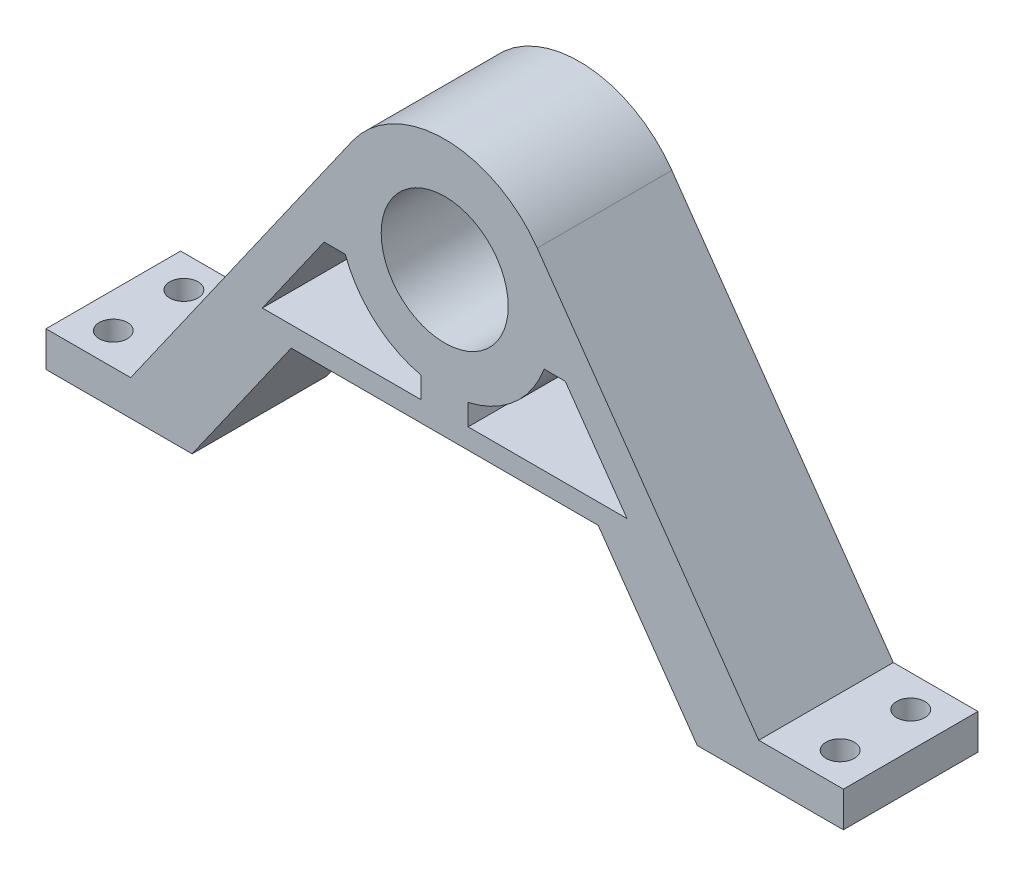
ISO-10303-21;
HEADER;
FILE_DESCRIPTION(('STEP AP214'),'2;1');
FILE_NAME('part.step','',(''),(''),'','','');
FILE_SCHEMA(('AUTOMOTIVE_DESIGN { 1 0 10303 214 1 1 1 1 }'));
ENDSEC;
DATA;
#1=APPLICATION_CONTEXT('core data for automotive mechanical design processes');
#2=APPLICATION_PROTOCOL_DEFINITION('international standard','automotive_design',2000,#1);
#3=PRODUCT_CONTEXT('',#1,'mechanical');
#4=PRODUCT('Part','Part','',(#3));
#5=PRODUCT_RELATED_PRODUCT_CATEGORY('part','',(#4));
#6=PRODUCT_DEFINITION_FORMATION('','',#4);
#7=PRODUCT_DEFINITION_CONTEXT('part definition',#1,'design');
#8=PRODUCT_DEFINITION('design','',#6,#7);
#9=PRODUCT_DEFINITION_SHAPE('','',#8);
#10=(LENGTH_UNIT() NAMED_UNIT(*) SI_UNIT(.MILLI.,.METRE.));
#11=(NAMED_UNIT(*) PLANE_ANGLE_UNIT() SI_UNIT($,.RADIAN.));
#12=(NAMED_UNIT(*) SI_UNIT($,.STERADIAN.) SOLID_ANGLE_UNIT());
#13=UNCERTAINTY_MEASURE_WITH_UNIT(LENGTH_MEASURE(1.E-05),#10,'distance_accuracy_value','');
#14=(GEOMETRIC_REPRESENTATION_CONTEXT(3) GLOBAL_UNCERTAINTY_ASSIGNED_CONTEXT((#13)) GLOBAL_UNIT_ASSIGNED_CONTEXT((#10,
#11,#12)) REPRESENTATION_CONTEXT('',''));
#15=CARTESIAN_POINT('',(0.,0.,0.));
#16=DIRECTION('',(0.,0.,1.));
#17=DIRECTION('',(1.,0.,0.));
#18=AXIS2_PLACEMENT_3D('',#15,#16,#17);
#19=CARTESIAN_POINT('',(0.,40.5,19.075));
#20=DIRECTION('',(0.,0.,-1.));
#21=DIRECTION('',(-1.,0.,0.));
#22=AXIS2_PLACEMENT_3D('',#19,#20,#21);
#23=CYLINDRICAL_SURFACE('',#22,9.);
#24=CARTESIAN_POINT('',(0.,40.5,19.075));
#25=DIRECTION('',(0.,0.,1.));
#26=DIRECTION('',(1.,0.,0.));
#27=AXIS2_PLACEMENT_3D('',#24,#25,#26);
#28=CIRCLE('',#27,9.);
#29=CARTESIAN_POINT('',(9.,40.5,19.075));
#30=VERTEX_POINT('',#29);
#31=EDGE_CURVE('E268',#30,#30,#28,.T.);
#32=ORIENTED_EDGE('',*,*,#31,.T.);
#33=EDGE_LOOP('',(#32));
#34=FACE_BOUND('',#33,.T.);
#35=CARTESIAN_POINT('',(0.,40.5,5.5));
#36=DIRECTION('',(0.,0.,-1.));
#37=DIRECTION('',(-1.,0.,0.));
#38=AXIS2_PLACEMENT_3D('',#35,#36,#37);
#39=CIRCLE('',#38,9.);
#40=CARTESIAN_POINT('',(-9.,40.5,5.5));
#41=VERTEX_POINT('',#40);
#42=EDGE_CURVE('E39',#41,#41,#39,.T.);
#43=ORIENTED_EDGE('',*,*,#42,.T.);
#44=EDGE_LOOP('',(#43));
#45=FACE_BOUND('',#44,.T.);
#46=ADVANCED_FACE('F35',(#34,#45),#23,.F.);
#47=CARTESIAN_POINT('',(0.,40.5,19.075));
#48=DIRECTION('',(0.,0.,1.));
#49=DIRECTION('',(1.,0.,0.));
#50=AXIS2_PLACEMENT_3D('',#47,#48,#49);
#51=PLANE('',#50);
#52=DIRECTION('',(1.,0.,0.));
#53=VECTOR('',#52,1.);
#54=CARTESIAN_POINT('',(56.5,0.,19.075));
#55=LINE('',#54,#53);
#56=CARTESIAN_POINT('',(35.791970862888,0.,19.075));
#57=VERTEX_POINT('',#56);
#58=CARTESIAN_POINT('',(56.5,0.,19.075));
#59=VERTEX_POINT('',#58);
#60=EDGE_CURVE('E272',#57,#59,#55,.T.);
#61=ORIENTED_EDGE('',*,*,#60,.T.);
#62=DIRECTION('',(0.,1.,0.));
#63=VECTOR('',#62,1.);
#64=CARTESIAN_POINT('',(56.5,0.,19.075));
#65=LINE('',#64,#63);
#66=CARTESIAN_POINT('',(56.5,5.,19.075));
#67=VERTEX_POINT('',#66);
#68=EDGE_CURVE('E275',#59,#67,#65,.T.);
#69=ORIENTED_EDGE('',*,*,#68,.T.);
#70=DIRECTION('',(-1.,0.,0.));
#71=VECTOR('',#70,1.);
#72=CARTESIAN_POINT('',(56.5,5.,19.075));
#73=LINE('',#72,#71);
#74=CARTESIAN_POINT('',(44.5,5.,19.075));
#75=VERTEX_POINT('',#74);
#76=EDGE_CURVE('E278',#67,#75,#73,.T.);
#77=ORIENTED_EDGE('',*,*,#76,.T.);
#78=DIRECTION('',(-0.574555500167892,0.818465623729442,0.));
#79=VECTOR('',#78,1.);
#80=CARTESIAN_POINT('',(13.1159116202643,49.7072518901905,19.075));
#81=LINE('',#80,#79);
#82=CARTESIAN_POINT('',(13.1159116202643,49.7072518901905,19.075));
#83=VERTEX_POINT('',#82);
#84=EDGE_CURVE('E280',#75,#83,#81,.T.);
#85=ORIENTED_EDGE('',*,*,#84,.T.);
#86=CARTESIAN_POINT('',(0.,40.5,19.075));
#87=DIRECTION('',(0.,0.,1.));
#88=DIRECTION('',(1.,0.,0.));
#89=AXIS2_PLACEMENT_3D('',#86,#87,#88);
#90=CIRCLE('',#89,16.025);
#91=CARTESIAN_POINT('',(-13.1159116202643,49.7072518901905,19.075));
#92=VERTEX_POINT('',#91);
#93=EDGE_CURVE('E282',#83,#92,#90,.T.);
#94=ORIENTED_EDGE('',*,*,#93,.T.);
#95=DIRECTION('',(-0.574555500167892,-0.818465623729442,0.));
#96=VECTOR('',#95,1.);
#97=CARTESIAN_POINT('',(-13.1159116202643,49.7072518901905,19.075));
#98=LINE('',#97,#96);
#99=CARTESIAN_POINT('',(-44.5,5.,19.075));
#100=VERTEX_POINT('',#99);
#101=EDGE_CURVE('E284',#92,#100,#98,.T.);
#102=ORIENTED_EDGE('',*,*,#101,.T.);
#103=DIRECTION('',(-1.,0.,0.));
#104=VECTOR('',#103,1.);
#105=CARTESIAN_POINT('',(-56.5,5.,19.075));
#106=LINE('',#105,#104);
#107=CARTESIAN_POINT('',(-56.5,5.,19.075));
#108=VERTEX_POINT('',#107);
#109=EDGE_CURVE('E286',#100,#108,#106,.T.);
#110=ORIENTED_EDGE('',*,*,#109,.T.);
#111=DIRECTION('',(0.,-1.,0.));
#112=VECTOR('',#111,1.);
#113=CARTESIAN_POINT('',(-56.5,0.,19.075));
#114=LINE('',#113,#112);
#115=CARTESIAN_POINT('',(-56.5,0.,19.075));
#116=VERTEX_POINT('',#115);
#117=EDGE_CURVE('E288',#108,#116,#114,.T.);
#118=ORIENTED_EDGE('',*,*,#117,.T.);
#119=DIRECTION('',(1.,0.,0.));
#120=VECTOR('',#119,1.);
#121=CARTESIAN_POINT('',(-56.5,0.,19.075));
#122=LINE('',#121,#120);
#123=CARTESIAN_POINT('',(-35.791970862888,0.,19.075));
#124=VERTEX_POINT('',#123);
#125=EDGE_CURVE('E290',#116,#124,#122,.T.);
#126=ORIENTED_EDGE('',*,*,#125,.T.);
#127=DIRECTION('',(0.574555500167892,0.818465623729441,0.));
#128=VECTOR('',#127,1.);
#129=CARTESIAN_POINT('',(-35.791970862888,0.,19.075));
#130=LINE('',#129,#128);
#131=CARTESIAN_POINT('',(-21.7521508995312,20.,19.075));
#132=VERTEX_POINT('',#131);
#133=EDGE_CURVE('E292',#124,#132,#130,.T.);
#134=ORIENTED_EDGE('',*,*,#133,.T.);
#135=DIRECTION('',(1.,0.,0.));
#136=VECTOR('',#135,1.);
#137=CARTESIAN_POINT('',(-21.7521508995312,20.,19.075));
#138=LINE('',#137,#136);
#139=CARTESIAN_POINT('',(21.7521508995312,20.,19.075));
#140=VERTEX_POINT('',#139);
#141=EDGE_CURVE('E294',#132,#140,#138,.T.);
#142=ORIENTED_EDGE('',*,*,#141,.T.);
#143=DIRECTION('',(0.574555500167891,-0.818465623729442,0.));
#144=VECTOR('',#143,1.);
#145=CARTESIAN_POINT('',(35.791970862888,0.,19.075));
#146=LINE('',#145,#144);
#147=EDGE_CURVE('E296',#140,#57,#146,.T.);
#148=ORIENTED_EDGE('',*,*,#147,.T.);
#149=EDGE_LOOP('',(#61,#69,#77,#85,#94,#102,#110,#118,#126,#134,#142,#148));
#150=FACE_BOUND('',#149,.T.);
#151=ORIENTED_EDGE('',*,*,#31,.F.);
#152=EDGE_LOOP('',(#151));
#153=FACE_BOUND('',#152,.T.);
#154=DIRECTION('',(-1.,0.,0.));
#155=VECTOR('',#154,1.);
#156=CARTESIAN_POINT('',(-17.0873058961482,35.347543053227,19.075));
#157=LINE('',#156,#155);
#158=CARTESIAN_POINT('',(-14.0873058961482,35.347543053227,19.075));
#159=VERTEX_POINT('',#158);
#160=CARTESIAN_POINT('',(-17.0873058961482,35.347543053227,19.075));
#161=VERTEX_POINT('',#160);
#162=EDGE_CURVE('E233',#159,#161,#157,.T.);
#163=ORIENTED_EDGE('',*,*,#162,.F.);
#164=CARTESIAN_POINT('',(0.,40.5,19.075));
#165=DIRECTION('',(0.,0.,-1.));
#166=DIRECTION('',(-1.,0.,0.));
#167=AXIS2_PLACEMENT_3D('',#164,#165,#166);
#168=CIRCLE('',#167,15.);
#169=CARTESIAN_POINT('',(-3.3233058781959,25.8727775008395,19.075));
#170=VERTEX_POINT('',#169);
#171=EDGE_CURVE('E231',#170,#159,#168,.T.);
#172=ORIENTED_EDGE('',*,*,#171,.F.);
#173=DIRECTION('',(0.,1.,0.));
#174=VECTOR('',#173,1.);
#175=CARTESIAN_POINT('',(-3.3233058781959,22.8727775008395,19.075));
#176=LINE('',#175,#174);
#177=CARTESIAN_POINT('',(-3.3233058781959,22.8727775008395,19.075));
#178=VERTEX_POINT('',#177);
#179=EDGE_CURVE('E241',#178,#170,#176,.T.);
#180=ORIENTED_EDGE('',*,*,#179,.F.);
#181=DIRECTION('',(1.,0.,0.));
#182=VECTOR('',#181,1.);
#183=CARTESIAN_POINT('',(-25.8444790181785,22.8727775008395,19.075));
#184=LINE('',#183,#182);
#185=CARTESIAN_POINT('',(-25.8444790181785,22.8727775008395,19.075));
#186=VERTEX_POINT('',#185);
#187=EDGE_CURVE('E238',#186,#178,#184,.T.);
#188=ORIENTED_EDGE('',*,*,#187,.F.);
#189=DIRECTION('',(-0.574555500167892,-0.818465623729441,0.));
#190=VECTOR('',#189,1.);
#191=CARTESIAN_POINT('',(-17.0873058961482,35.347543053227,19.075));
#192=LINE('',#191,#190);
#193=EDGE_CURVE('E236',#161,#186,#192,.T.);
#194=ORIENTED_EDGE('',*,*,#193,.F.);
#195=EDGE_LOOP('',(#163,#172,#180,#188,#194));
#196=FACE_BOUND('',#195,.T.);
#197=DIRECTION('',(0.,-1.,0.));
#198=VECTOR('',#197,1.);
#199=CARTESIAN_POINT('',(3.3233058781959,22.8727775008394,19.075));
#200=LINE('',#199,#198);
#201=CARTESIAN_POINT('',(3.3233058781959,25.8727775008394,19.075));
#202=VERTEX_POINT('',#201);
#203=CARTESIAN_POINT('',(3.3233058781959,22.8727775008394,19.075));
#204=VERTEX_POINT('',#203);
#205=EDGE_CURVE('E193',#202,#204,#200,.T.);
#206=ORIENTED_EDGE('',*,*,#205,.F.);
#207=CARTESIAN_POINT('',(0.,40.5,19.075));
#208=DIRECTION('',(0.,0.,-1.));
#209=DIRECTION('',(1.,0.,0.));
#210=AXIS2_PLACEMENT_3D('',#207,#208,#209);
#211=CIRCLE('',#210,15.);
#212=CARTESIAN_POINT('',(14.0873058961482,35.347543053227,19.075));
#213=VERTEX_POINT('',#212);
#214=EDGE_CURVE('E185',#213,#202,#211,.T.);
#215=ORIENTED_EDGE('',*,*,#214,.F.);
#216=DIRECTION('',(-1.,0.,0.));
#217=VECTOR('',#216,1.);
#218=CARTESIAN_POINT('',(17.0873058961482,35.347543053227,19.075));
#219=LINE('',#218,#217);
#220=CARTESIAN_POINT('',(17.0873058961482,35.347543053227,19.075));
#221=VERTEX_POINT('',#220);
#222=EDGE_CURVE('E214',#221,#213,#219,.T.);
#223=ORIENTED_EDGE('',*,*,#222,.F.);
#224=DIRECTION('',(-0.574555500167893,0.818465623729441,0.));
#225=VECTOR('',#224,1.);
#226=CARTESIAN_POINT('',(17.0873058961482,35.347543053227,19.075));
#227=LINE('',#226,#225);
#228=CARTESIAN_POINT('',(25.8444790181785,22.8727775008394,19.075));
#229=VERTEX_POINT('',#228);
#230=EDGE_CURVE('E209',#229,#221,#227,.T.);
#231=ORIENTED_EDGE('',*,*,#230,.F.);
#232=DIRECTION('',(1.,0.,0.));
#233=VECTOR('',#232,1.);
#234=CARTESIAN_POINT('',(25.8444790181785,22.8727775008394,19.075));
#235=LINE('',#234,#233);
#236=EDGE_CURVE('E207',#204,#229,#235,.T.);
#237=ORIENTED_EDGE('',*,*,#236,.F.);
#238=EDGE_LOOP('',(#206,#215,#223,#231,#237));
#239=FACE_BOUND('',#238,.T.);
#240=ADVANCED_FACE('F205',(#150,#153,#196,#239),#51,.T.);
#241=CARTESIAN_POINT('',(0.,40.5,0.));
#242=DIRECTION('',(0.,0.,1.));
#243=DIRECTION('',(1.,0.,0.));
#244=AXIS2_PLACEMENT_3D('',#241,#242,#243);
#245=PLANE('',#244);
#246=CARTESIAN_POINT('',(0.,40.5,0.));
#247=DIRECTION('',(0.,0.,-1.));
#248=DIRECTION('',(-1.,0.,0.));
#249=AXIS2_PLACEMENT_3D('',#246,#247,#248);
#250=CIRCLE('',#249,11.025);
#251=CARTESIAN_POINT('',(-11.025,40.5,0.));
#252=VERTEX_POINT('',#251);
#253=EDGE_CURVE('E721',#252,#252,#250,.T.);
#254=ORIENTED_EDGE('',*,*,#253,.F.);
#255=EDGE_LOOP('',(#254));
#256=FACE_BOUND('',#255,.T.);
#257=CARTESIAN_POINT('',(0.,40.5,0.));
#258=DIRECTION('',(0.,0.,-1.));
#259=DIRECTION('',(-1.,0.,0.));
#260=AXIS2_PLACEMENT_3D('',#257,#258,#259);
#261=CIRCLE('',#260,15.);
#262=CARTESIAN_POINT('',(-3.3233058781959,25.8727775008395,0.));
#263=VERTEX_POINT('',#262);
#264=CARTESIAN_POINT('',(-14.0873058961482,35.347543053227,0.));
#265=VERTEX_POINT('',#264);
#266=EDGE_CURVE('E201',#263,#265,#261,.T.);
#267=ORIENTED_EDGE('',*,*,#266,.T.);
#268=DIRECTION('',(-1.,0.,0.));
#269=VECTOR('',#268,1.);
#270=CARTESIAN_POINT('',(-17.0873058961482,35.347543053227,0.));
#271=LINE('',#270,#269);
#272=CARTESIAN_POINT('',(-17.0873058961482,35.347543053227,0.));
#273=VERTEX_POINT('',#272);
#274=EDGE_CURVE('E246',#265,#273,#271,.T.);
#275=ORIENTED_EDGE('',*,*,#274,.T.);
#276=DIRECTION('',(-0.574555500167892,-0.818465623729441,0.));
#277=VECTOR('',#276,1.);
#278=CARTESIAN_POINT('',(-17.0873058961482,35.347543053227,0.));
#279=LINE('',#278,#277);
#280=CARTESIAN_POINT('',(-25.8444790181785,22.8727775008395,0.));
#281=VERTEX_POINT('',#280);
#282=EDGE_CURVE('E249',#273,#281,#279,.T.);
#283=ORIENTED_EDGE('',*,*,#282,.T.);
#284=DIRECTION('',(1.,0.,0.));
#285=VECTOR('',#284,1.);
#286=CARTESIAN_POINT('',(-25.8444790181785,22.8727775008395,0.));
#287=LINE('',#286,#285);
#288=CARTESIAN_POINT('',(-3.3233058781959,22.8727775008395,0.));
#289=VERTEX_POINT('',#288);
#290=EDGE_CURVE('E252',#281,#289,#287,.T.);
#291=ORIENTED_EDGE('',*,*,#290,.T.);
#292=DIRECTION('',(0.,1.,0.));
#293=VECTOR('',#292,1.);
#294=CARTESIAN_POINT('',(-3.3233058781959,22.8727775008395,0.));
#295=LINE('',#294,#293);
#296=EDGE_CURVE('E234',#289,#263,#295,.T.);
#297=ORIENTED_EDGE('',*,*,#296,.T.);
#298=EDGE_LOOP('',(#267,#275,#283,#291,#297));
#299=FACE_BOUND('',#298,.T.);
#300=DIRECTION('',(1.,0.,0.));
#301=VECTOR('',#300,1.);
#302=CARTESIAN_POINT('',(56.5,0.,0.));
#303=LINE('',#302,#301);
#304=CARTESIAN_POINT('',(35.791970862888,0.,0.));
#305=VERTEX_POINT('',#304);
#306=CARTESIAN_POINT('',(56.5,0.,0.));
#307=VERTEX_POINT('',#306);
#308=EDGE_CURVE('E271',#305,#307,#303,.T.);
#309=ORIENTED_EDGE('',*,*,#308,.F.);
#310=DIRECTION('',(0.574555500167891,-0.818465623729442,0.));
#311=VECTOR('',#310,1.);
#312=CARTESIAN_POINT('',(35.791970862888,0.,0.));
#313=LINE('',#312,#311);
#314=CARTESIAN_POINT('',(21.7521508995312,20.,0.));
#315=VERTEX_POINT('',#314);
#316=EDGE_CURVE('E276',#315,#305,#313,.T.);
#317=ORIENTED_EDGE('',*,*,#316,.F.);
#318=DIRECTION('',(1.,0.,0.));
#319=VECTOR('',#318,1.);
#320=CARTESIAN_POINT('',(-21.7521508995312,20.,0.));
#321=LINE('',#320,#319);
#322=CARTESIAN_POINT('',(-21.7521508995312,20.,0.));
#323=VERTEX_POINT('',#322);
#324=EDGE_CURVE('E319',#323,#315,#321,.T.);
#325=ORIENTED_EDGE('',*,*,#324,.F.);
#326=DIRECTION('',(0.574555500167892,0.818465623729441,0.));
#327=VECTOR('',#326,1.);
#328=CARTESIAN_POINT('',(-35.791970862888,0.,0.));
#329=LINE('',#328,#327);
#330=CARTESIAN_POINT('',(-35.791970862888,0.,0.));
#331=VERTEX_POINT('',#330);
#332=EDGE_CURVE('E317',#331,#323,#329,.T.);
#333=ORIENTED_EDGE('',*,*,#332,.F.);
#334=DIRECTION('',(1.,0.,0.));
#335=VECTOR('',#334,1.);
#336=CARTESIAN_POINT('',(-56.5,0.,0.));
#337=LINE('',#336,#335);
#338=CARTESIAN_POINT('',(-56.5,0.,0.));
#339=VERTEX_POINT('',#338);
#340=EDGE_CURVE('E315',#339,#331,#337,.T.);
#341=ORIENTED_EDGE('',*,*,#340,.F.);
#342=DIRECTION('',(0.,-1.,0.));
#343=VECTOR('',#342,1.);
#344=CARTESIAN_POINT('',(-56.5,0.,0.));
#345=LINE('',#344,#343);
#346=CARTESIAN_POINT('',(-56.5,5.,0.));
#347=VERTEX_POINT('',#346);
#348=EDGE_CURVE('E313',#347,#339,#345,.T.);
#349=ORIENTED_EDGE('',*,*,#348,.F.);
#350=DIRECTION('',(-1.,0.,0.));
#351=VECTOR('',#350,1.);
#352=CARTESIAN_POINT('',(-56.5,5.,0.));
#353=LINE('',#352,#351);
#354=CARTESIAN_POINT('',(-44.5,5.,0.));
#355=VERTEX_POINT('',#354);
#356=EDGE_CURVE('E311',#355,#347,#353,.T.);
#357=ORIENTED_EDGE('',*,*,#356,.F.);
#358=DIRECTION('',(-0.574555500167892,-0.818465623729442,0.));
#359=VECTOR('',#358,1.);
#360=CARTESIAN_POINT('',(-13.1159116202643,49.7072518901905,0.));
#361=LINE('',#360,#359);
#362=CARTESIAN_POINT('',(-13.1159116202643,49.7072518901905,0.));
#363=VERTEX_POINT('',#362);
#364=EDGE_CURVE('E309',#363,#355,#361,.T.);
#365=ORIENTED_EDGE('',*,*,#364,.F.);
#366=CARTESIAN_POINT('',(0.,40.5,0.));
#367=DIRECTION('',(0.,0.,1.));
#368=DIRECTION('',(1.,0.,0.));
#369=AXIS2_PLACEMENT_3D('',#366,#367,#368);
#370=CIRCLE('',#369,16.025);
#371=CARTESIAN_POINT('',(13.1159116202643,49.7072518901905,0.));
#372=VERTEX_POINT('',#371);
#373=EDGE_CURVE('E307',#372,#363,#370,.T.);
#374=ORIENTED_EDGE('',*,*,#373,.F.);
#375=DIRECTION('',(-0.574555500167892,0.818465623729442,0.));
#376=VECTOR('',#375,1.);
#377=CARTESIAN_POINT('',(13.1159116202643,49.7072518901905,0.));
#378=LINE('',#377,#376);
#379=CARTESIAN_POINT('',(44.5,5.,0.));
#380=VERTEX_POINT('',#379);
#381=EDGE_CURVE('E305',#380,#372,#378,.T.);
#382=ORIENTED_EDGE('',*,*,#381,.F.);
#383=DIRECTION('',(-1.,0.,0.));
#384=VECTOR('',#383,1.);
#385=CARTESIAN_POINT('',(56.5,5.,0.));
#386=LINE('',#385,#384);
#387=CARTESIAN_POINT('',(56.5,5.,0.));
#388=VERTEX_POINT('',#387);
#389=EDGE_CURVE('E303',#388,#380,#386,.T.);
#390=ORIENTED_EDGE('',*,*,#389,.F.);
#391=DIRECTION('',(0.,1.,0.));
#392=VECTOR('',#391,1.);
#393=CARTESIAN_POINT('',(56.5,0.,0.));
#394=LINE('',#393,#392);
#395=EDGE_CURVE('E301',#307,#388,#394,.T.);
#396=ORIENTED_EDGE('',*,*,#395,.F.);
#397=EDGE_LOOP('',(#309,#317,#325,#333,#341,#349,#357,#365,#374,#382,#390,#396));
#398=FACE_BOUND('',#397,.T.);
#399=CARTESIAN_POINT('',(0.,40.5,0.));
#400=DIRECTION('',(0.,0.,-1.));
#401=DIRECTION('',(1.,0.,0.));
#402=AXIS2_PLACEMENT_3D('',#399,#400,#401);
#403=CIRCLE('',#402,15.);
#404=CARTESIAN_POINT('',(14.0873058961482,35.347543053227,0.));
#405=VERTEX_POINT('',#404);
#406=CARTESIAN_POINT('',(3.3233058781959,25.8727775008394,0.));
#407=VERTEX_POINT('',#406);
#408=EDGE_CURVE('E59',#405,#407,#403,.T.);
#409=ORIENTED_EDGE('',*,*,#408,.T.);
#410=DIRECTION('',(0.,-1.,0.));
#411=VECTOR('',#410,1.);
#412=CARTESIAN_POINT('',(3.3233058781959,22.8727775008394,0.));
#413=LINE('',#412,#411);
#414=CARTESIAN_POINT('',(3.3233058781959,22.8727775008394,0.));
#415=VERTEX_POINT('',#414);
#416=EDGE_CURVE('E200',#407,#415,#413,.T.);
#417=ORIENTED_EDGE('',*,*,#416,.T.);
#418=DIRECTION('',(1.,0.,0.));
#419=VECTOR('',#418,1.);
#420=CARTESIAN_POINT('',(25.8444790181785,22.8727775008394,0.));
#421=LINE('',#420,#419);
#422=CARTESIAN_POINT('',(25.8444790181785,22.8727775008394,0.));
#423=VERTEX_POINT('',#422);
#424=EDGE_CURVE('E218',#415,#423,#421,.T.);
#425=ORIENTED_EDGE('',*,*,#424,.T.);
#426=DIRECTION('',(-0.574555500167893,0.818465623729441,0.));
#427=VECTOR('',#426,1.);
#428=CARTESIAN_POINT('',(17.0873058961482,35.347543053227,0.));
#429=LINE('',#428,#427);
#430=CARTESIAN_POINT('',(17.0873058961482,35.347543053227,0.));
#431=VERTEX_POINT('',#430);
#432=EDGE_CURVE('E221',#423,#431,#429,.T.);
#433=ORIENTED_EDGE('',*,*,#432,.T.);
#434=DIRECTION('',(-1.,0.,0.));
#435=VECTOR('',#434,1.);
#436=CARTESIAN_POINT('',(17.0873058961482,35.347543053227,0.));
#437=LINE('',#436,#435);
#438=EDGE_CURVE('E194',#431,#405,#437,.T.);
#439=ORIENTED_EDGE('',*,*,#438,.T.);
#440=EDGE_LOOP('',(#409,#417,#425,#433,#439));
#441=FACE_BOUND('',#440,.T.);
#442=ADVANCED_FACE('F362',(#256,#299,#398,#441),#245,.F.);
#443=CARTESIAN_POINT('',(56.5,0.,19.075));
#444=DIRECTION('',(0.,1.,0.));
#445=DIRECTION('',(0.,0.,1.));
#446=AXIS2_PLACEMENT_3D('',#443,#444,#445);
#447=PLANE('',#446);
#448=CARTESIAN_POINT('',(51.5,0.,14.5375));
#449=DIRECTION('',(0.,1.,0.));
#450=DIRECTION('',(-1.,0.,0.));
#451=AXIS2_PLACEMENT_3D('',#448,#449,#450);
#452=CIRCLE('',#451,2.);
#453=CARTESIAN_POINT('',(49.5,0.,14.5375));
#454=VERTEX_POINT('',#453);
#455=EDGE_CURVE('E697',#454,#454,#452,.T.);
#456=ORIENTED_EDGE('',*,*,#455,.T.);
#457=EDGE_LOOP('',(#456));
#458=FACE_BOUND('',#457,.T.);
#459=CARTESIAN_POINT('',(51.5,0.,4.53749999999999));
#460=DIRECTION('',(0.,1.,0.));
#461=DIRECTION('',(1.,0.,0.));
#462=AXIS2_PLACEMENT_3D('',#459,#460,#461);
#463=CIRCLE('',#462,2.);
#464=CARTESIAN_POINT('',(53.5,0.,4.53749999999999));
#465=VERTEX_POINT('',#464);
#466=EDGE_CURVE('E700',#465,#465,#463,.T.);
#467=ORIENTED_EDGE('',*,*,#466,.T.);
#468=EDGE_LOOP('',(#467));
#469=FACE_BOUND('',#468,.T.);
#470=ORIENTED_EDGE('',*,*,#308,.T.);
#471=DIRECTION('',(0.,0.,-1.));
#472=VECTOR('',#471,1.);
#473=CARTESIAN_POINT('',(56.5,0.,19.075));
#474=LINE('',#473,#472);
#475=EDGE_CURVE('E11',#59,#307,#474,.T.);
#476=ORIENTED_EDGE('',*,*,#475,.F.);
#477=ORIENTED_EDGE('',*,*,#60,.F.);
#478=DIRECTION('',(0.,0.,-1.));
#479=VECTOR('',#478,1.);
#480=CARTESIAN_POINT('',(35.791970862888,0.,19.075));
#481=LINE('',#480,#479);
#482=EDGE_CURVE('E298',#57,#305,#481,.T.);
#483=ORIENTED_EDGE('',*,*,#482,.T.);
#484=EDGE_LOOP('',(#470,#476,#477,#483));
#485=FACE_BOUND('',#484,.T.);
#486=ADVANCED_FACE('F37',(#458,#469,#485),#447,.F.);
#487=CARTESIAN_POINT('',(56.5,0.,19.075));
#488=DIRECTION('',(-1.,0.,0.));
#489=DIRECTION('',(0.,0.,1.));
#490=AXIS2_PLACEMENT_3D('',#487,#488,#489);
#491=PLANE('',#490);
#492=ORIENTED_EDGE('',*,*,#395,.T.);
#493=DIRECTION('',(0.,0.,-1.));
#494=VECTOR('',#493,1.);
#495=CARTESIAN_POINT('',(56.5,5.,19.075));
#496=LINE('',#495,#494);
#497=EDGE_CURVE('E44',#67,#388,#496,.T.);
#498=ORIENTED_EDGE('',*,*,#497,.F.);
#499=ORIENTED_EDGE('',*,*,#68,.F.);
#500=ORIENTED_EDGE('',*,*,#475,.T.);
#501=EDGE_LOOP('',(#492,#498,#499,#500));
#502=FACE_BOUND('',#501,.T.);
#503=ADVANCED_FACE('F380',(#502),#491,.F.);
#504=CARTESIAN_POINT('',(56.5,5.,19.075));
#505=DIRECTION('',(0.,-1.,0.));
#506=DIRECTION('',(1.,0.,0.));
#507=AXIS2_PLACEMENT_3D('',#504,#505,#506);
#508=PLANE('',#507);
#509=CARTESIAN_POINT('',(51.5,5.,14.5375));
#510=DIRECTION('',(0.,1.,0.));
#511=DIRECTION('',(-1.,0.,0.));
#512=AXIS2_PLACEMENT_3D('',#509,#510,#511);
#513=CIRCLE('',#512,2.);
#514=CARTESIAN_POINT('',(49.5,5.,14.5375));
#515=VERTEX_POINT('',#514);
#516=EDGE_CURVE('E711',#515,#515,#513,.T.);
#517=ORIENTED_EDGE('',*,*,#516,.F.);
#518=EDGE_LOOP('',(#517));
#519=FACE_BOUND('',#518,.T.);
#520=CARTESIAN_POINT('',(51.5,5.,4.53749999999999));
#521=DIRECTION('',(0.,1.,0.));
#522=DIRECTION('',(1.,0.,0.));
#523=AXIS2_PLACEMENT_3D('',#520,#521,#522);
#524=CIRCLE('',#523,2.);
#525=CARTESIAN_POINT('',(53.5,5.,4.53749999999999));
#526=VERTEX_POINT('',#525);
#527=EDGE_CURVE('E702',#526,#526,#524,.T.);
#528=ORIENTED_EDGE('',*,*,#527,.F.);
#529=EDGE_LOOP('',(#528));
#530=FACE_BOUND('',#529,.T.);
#531=ORIENTED_EDGE('',*,*,#389,.T.);
#532=DIRECTION('',(0.,0.,-1.));
#533=VECTOR('',#532,1.);
#534=CARTESIAN_POINT('',(44.5,5.,19.075));
#535=LINE('',#534,#533);
#536=EDGE_CURVE('E348',#75,#380,#535,.T.);
#537=ORIENTED_EDGE('',*,*,#536,.F.);
#538=ORIENTED_EDGE('',*,*,#76,.F.);
#539=ORIENTED_EDGE('',*,*,#497,.T.);
#540=EDGE_LOOP('',(#531,#537,#538,#539));
#541=FACE_BOUND('',#540,.T.);
#542=ADVANCED_FACE('F356',(#519,#530,#541),#508,.F.);
#543=CARTESIAN_POINT('',(13.1159116202643,49.7072518901905,19.075));
#544=DIRECTION('',(-0.818465623729442,-0.574555500167892,0.));
#545=DIRECTION('',(0.574555500167892,-0.818465623729442,0.));
#546=AXIS2_PLACEMENT_3D('',#543,#544,#545);
#547=PLANE('',#546);
#548=ORIENTED_EDGE('',*,*,#381,.T.);
#549=DIRECTION('',(0.,0.,-1.));
#550=VECTOR('',#549,1.);
#551=CARTESIAN_POINT('',(13.1159116202643,49.7072518901905,19.075));
#552=LINE('',#551,#550);
#553=EDGE_CURVE('E345',#83,#372,#552,.T.);
#554=ORIENTED_EDGE('',*,*,#553,.F.);
#555=ORIENTED_EDGE('',*,*,#84,.F.);
#556=ORIENTED_EDGE('',*,*,#536,.T.);
#557=EDGE_LOOP('',(#548,#554,#555,#556));
#558=FACE_BOUND('',#557,.T.);
#559=ADVANCED_FACE('F368',(#558),#547,.F.);
#560=CARTESIAN_POINT('',(0.,40.5,19.075));
#561=DIRECTION('',(0.,0.,-1.));
#562=DIRECTION('',(-1.,0.,0.));
#563=AXIS2_PLACEMENT_3D('',#560,#561,#562);
#564=CYLINDRICAL_SURFACE('',#563,16.025);
#565=ORIENTED_EDGE('',*,*,#373,.T.);
#566=DIRECTION('',(0.,0.,-1.));
#567=VECTOR('',#566,1.);
#568=CARTESIAN_POINT('',(-13.1159116202643,49.7072518901905,19.075));
#569=LINE('',#568,#567);
#570=EDGE_CURVE('E342',#92,#363,#569,.T.);
#571=ORIENTED_EDGE('',*,*,#570,.F.);
#572=ORIENTED_EDGE('',*,*,#93,.F.);
#573=ORIENTED_EDGE('',*,*,#553,.T.);
#574=EDGE_LOOP('',(#565,#571,#572,#573));
#575=FACE_BOUND('',#574,.T.);
#576=ADVANCED_FACE('F372',(#575),#564,.T.);
#577=CARTESIAN_POINT('',(-13.1159116202643,49.7072518901905,19.075));
#578=DIRECTION('',(0.818465623729442,-0.574555500167892,0.));
#579=DIRECTION('',(0.574555500167892,0.818465623729442,0.));
#580=AXIS2_PLACEMENT_3D('',#577,#578,#579);
#581=PLANE('',#580);
#582=ORIENTED_EDGE('',*,*,#364,.T.);
#583=DIRECTION('',(0.,0.,-1.));
#584=VECTOR('',#583,1.);
#585=CARTESIAN_POINT('',(-44.5,5.,19.075));
#586=LINE('',#585,#584);
#587=EDGE_CURVE('E339',#100,#355,#586,.T.);
#588=ORIENTED_EDGE('',*,*,#587,.F.);
#589=ORIENTED_EDGE('',*,*,#101,.F.);
#590=ORIENTED_EDGE('',*,*,#570,.T.);
#591=EDGE_LOOP('',(#582,#588,#589,#590));
#592=FACE_BOUND('',#591,.T.);
#593=ADVANCED_FACE('F413',(#592),#581,.F.);
#594=CARTESIAN_POINT('',(-56.5,5.,19.075));
#595=DIRECTION('',(0.,-1.,0.));
#596=DIRECTION('',(1.,0.,0.));
#597=AXIS2_PLACEMENT_3D('',#594,#595,#596);
#598=PLANE('',#597);
#599=CARTESIAN_POINT('',(-51.5,4.99999999999999,14.5375));
#600=DIRECTION('',(0.,1.,0.));
#601=DIRECTION('',(1.,0.,0.));
#602=AXIS2_PLACEMENT_3D('',#599,#600,#601);
#603=CIRCLE('',#602,2.);
#604=CARTESIAN_POINT('',(-49.5,4.99999999999999,14.5375));
#605=VERTEX_POINT('',#604);
#606=EDGE_CURVE('E717',#605,#605,#603,.T.);
#607=ORIENTED_EDGE('',*,*,#606,.F.);
#608=EDGE_LOOP('',(#607));
#609=FACE_BOUND('',#608,.T.);
#610=CARTESIAN_POINT('',(-51.5,4.99999999999999,4.53750000000001));
#611=DIRECTION('',(0.,1.,0.));
#612=DIRECTION('',(-1.,0.,0.));
#613=AXIS2_PLACEMENT_3D('',#610,#611,#612);
#614=CIRCLE('',#613,2.);
#615=CARTESIAN_POINT('',(-53.5,4.99999999999999,4.53750000000001));
#616=VERTEX_POINT('',#615);
#617=EDGE_CURVE('E701',#616,#616,#614,.T.);
#618=ORIENTED_EDGE('',*,*,#617,.F.);
#619=EDGE_LOOP('',(#618));
#620=FACE_BOUND('',#619,.T.);
#621=ORIENTED_EDGE('',*,*,#356,.T.);
#622=DIRECTION('',(0.,0.,-1.));
#623=VECTOR('',#622,1.);
#624=CARTESIAN_POINT('',(-56.5,5.,19.075));
#625=LINE('',#624,#623);
#626=EDGE_CURVE('E336',#108,#347,#625,.T.);
#627=ORIENTED_EDGE('',*,*,#626,.F.);
#628=ORIENTED_EDGE('',*,*,#109,.F.);
#629=ORIENTED_EDGE('',*,*,#587,.T.);
#630=EDGE_LOOP('',(#621,#627,#628,#629));
#631=FACE_BOUND('',#630,.T.);
#632=ADVANCED_FACE('F411',(#609,#620,#631),#598,.F.);
#633=CARTESIAN_POINT('',(-56.5,0.,19.075));
#634=DIRECTION('',(1.,0.,0.));
#635=DIRECTION('',(0.,0.,-1.));
#636=AXIS2_PLACEMENT_3D('',#633,#634,#635);
#637=PLANE('',#636);
#638=ORIENTED_EDGE('',*,*,#348,.T.);
#639=DIRECTION('',(0.,0.,-1.));
#640=VECTOR('',#639,1.);
#641=CARTESIAN_POINT('',(-56.5,0.,19.075));
#642=LINE('',#641,#640);
#643=EDGE_CURVE('E333',#116,#339,#642,.T.);
#644=ORIENTED_EDGE('',*,*,#643,.F.);
#645=ORIENTED_EDGE('',*,*,#117,.F.);
#646=ORIENTED_EDGE('',*,*,#626,.T.);
#647=EDGE_LOOP('',(#638,#644,#645,#646));
#648=FACE_BOUND('',#647,.T.);
#649=ADVANCED_FACE('F407',(#648),#637,.F.);
#650=CARTESIAN_POINT('',(-56.5,0.,19.075));
#651=DIRECTION('',(0.,1.,0.));
#652=DIRECTION('',(0.,0.,1.));
#653=AXIS2_PLACEMENT_3D('',#650,#651,#652);
#654=PLANE('',#653);
#655=CARTESIAN_POINT('',(-51.5,0.,14.5375));
#656=DIRECTION('',(0.,1.,0.));
#657=DIRECTION('',(1.,0.,0.));
#658=AXIS2_PLACEMENT_3D('',#655,#656,#657);
#659=CIRCLE('',#658,2.);
#660=CARTESIAN_POINT('',(-49.5,0.,14.5375));
#661=VERTEX_POINT('',#660);
#662=EDGE_CURVE('E714',#661,#661,#659,.T.);
#663=ORIENTED_EDGE('',*,*,#662,.T.);
#664=EDGE_LOOP('',(#663));
#665=FACE_BOUND('',#664,.T.);
#666=CARTESIAN_POINT('',(-51.5,0.,4.53750000000001));
#667=DIRECTION('',(0.,1.,0.));
#668=DIRECTION('',(-1.,0.,0.));
#669=AXIS2_PLACEMENT_3D('',#666,#667,#668);
#670=CIRCLE('',#669,2.);
#671=CARTESIAN_POINT('',(-53.5,0.,4.53750000000001));
#672=VERTEX_POINT('',#671);
#673=EDGE_CURVE('E705',#672,#672,#670,.T.);
#674=ORIENTED_EDGE('',*,*,#673,.T.);
#675=EDGE_LOOP('',(#674));
#676=FACE_BOUND('',#675,.T.);
#677=ORIENTED_EDGE('',*,*,#340,.T.);
#678=DIRECTION('',(0.,0.,-1.));
#679=VECTOR('',#678,1.);
#680=CARTESIAN_POINT('',(-35.791970862888,0.,19.075));
#681=LINE('',#680,#679);
#682=EDGE_CURVE('E330',#124,#331,#681,.T.);
#683=ORIENTED_EDGE('',*,*,#682,.F.);
#684=ORIENTED_EDGE('',*,*,#125,.F.);
#685=ORIENTED_EDGE('',*,*,#643,.T.);
#686=EDGE_LOOP('',(#677,#683,#684,#685));
#687=FACE_BOUND('',#686,.T.);
#688=ADVANCED_FACE('F402',(#665,#676,#687),#654,.F.);
#689=CARTESIAN_POINT('',(-35.791970862888,0.,19.075));
#690=DIRECTION('',(-0.818465623729441,0.574555500167892,0.));
#691=DIRECTION('',(-0.574555500167892,-0.818465623729441,0.));
#692=AXIS2_PLACEMENT_3D('',#689,#690,#691);
#693=PLANE('',#692);
#694=ORIENTED_EDGE('',*,*,#332,.T.);
#695=DIRECTION('',(0.,0.,-1.));
#696=VECTOR('',#695,1.);
#697=CARTESIAN_POINT('',(-21.7521508995312,20.,19.075));
#698=LINE('',#697,#696);
#699=EDGE_CURVE('E327',#132,#323,#698,.T.);
#700=ORIENTED_EDGE('',*,*,#699,.F.);
#701=ORIENTED_EDGE('',*,*,#133,.F.);
#702=ORIENTED_EDGE('',*,*,#682,.T.);
#703=EDGE_LOOP('',(#694,#700,#701,#702));
#704=FACE_BOUND('',#703,.T.);
#705=ADVANCED_FACE('F396',(#704),#693,.F.);
#706=CARTESIAN_POINT('',(-21.7521508995312,20.,19.075));
#707=DIRECTION('',(0.,1.,0.));
#708=DIRECTION('',(-1.,0.,0.));
#709=AXIS2_PLACEMENT_3D('',#706,#707,#708);
#710=PLANE('',#709);
#711=ORIENTED_EDGE('',*,*,#324,.T.);
#712=DIRECTION('',(0.,0.,-1.));
#713=VECTOR('',#712,1.);
#714=CARTESIAN_POINT('',(21.7521508995312,20.,19.075));
#715=LINE('',#714,#713);
#716=EDGE_CURVE('E324',#140,#315,#715,.T.);
#717=ORIENTED_EDGE('',*,*,#716,.F.);
#718=ORIENTED_EDGE('',*,*,#141,.F.);
#719=ORIENTED_EDGE('',*,*,#699,.T.);
#720=EDGE_LOOP('',(#711,#717,#718,#719));
#721=FACE_BOUND('',#720,.T.);
#722=ADVANCED_FACE('F392',(#721),#710,.F.);
#723=CARTESIAN_POINT('',(35.791970862888,0.,19.075));
#724=DIRECTION('',(0.818465623729442,0.574555500167892,0.));
#725=DIRECTION('',(-0.574555500167892,0.818465623729442,0.));
#726=AXIS2_PLACEMENT_3D('',#723,#724,#725);
#727=PLANE('',#726);
#728=ORIENTED_EDGE('',*,*,#316,.T.);
#729=ORIENTED_EDGE('',*,*,#482,.F.);
#730=ORIENTED_EDGE('',*,*,#147,.F.);
#731=ORIENTED_EDGE('',*,*,#716,.T.);
#732=EDGE_LOOP('',(#728,#729,#730,#731));
#733=FACE_BOUND('',#732,.T.);
#734=ADVANCED_FACE('F387',(#733),#727,.F.);
#735=CARTESIAN_POINT('',(0.,40.5,19.075));
#736=DIRECTION('',(0.,0.,-1.));
#737=DIRECTION('',(-1.,0.,0.));
#738=AXIS2_PLACEMENT_3D('',#735,#736,#737);
#739=CYLINDRICAL_SURFACE('',#738,15.);
#740=ORIENTED_EDGE('',*,*,#266,.F.);
#741=DIRECTION('',(0.,0.,-1.));
#742=VECTOR('',#741,1.);
#743=CARTESIAN_POINT('',(-3.3233058781959,25.8727775008395,19.075));
#744=LINE('',#743,#742);
#745=EDGE_CURVE('E243',#170,#263,#744,.T.);
#746=ORIENTED_EDGE('',*,*,#745,.F.);
#747=ORIENTED_EDGE('',*,*,#171,.T.);
#748=DIRECTION('',(0.,0.,-1.));
#749=VECTOR('',#748,1.);
#750=CARTESIAN_POINT('',(-14.0873058961482,35.347543053227,19.075));
#751=LINE('',#750,#749);
#752=EDGE_CURVE('E265',#159,#265,#751,.T.);
#753=ORIENTED_EDGE('',*,*,#752,.T.);
#754=EDGE_LOOP('',(#740,#746,#747,#753));
#755=FACE_BOUND('',#754,.T.);
#756=ADVANCED_FACE('F432',(#755),#739,.T.);
#757=CARTESIAN_POINT('',(-17.0873058961482,35.347543053227,19.075));
#758=DIRECTION('',(0.,-1.,0.));
#759=DIRECTION('',(0.,0.,-1.));
#760=AXIS2_PLACEMENT_3D('',#757,#758,#759);
#761=PLANE('',#760);
#762=ORIENTED_EDGE('',*,*,#274,.F.);
#763=ORIENTED_EDGE('',*,*,#752,.F.);
#764=ORIENTED_EDGE('',*,*,#162,.T.);
#765=DIRECTION('',(0.,0.,-1.));
#766=VECTOR('',#765,1.);
#767=CARTESIAN_POINT('',(-17.0873058961482,35.347543053227,19.075));
#768=LINE('',#767,#766);
#769=EDGE_CURVE('E263',#161,#273,#768,.T.);
#770=ORIENTED_EDGE('',*,*,#769,.T.);
#771=EDGE_LOOP('',(#762,#763,#764,#770));
#772=FACE_BOUND('',#771,.T.);
#773=ADVANCED_FACE('F475',(#772),#761,.T.);
#774=CARTESIAN_POINT('',(-17.0873058961482,35.347543053227,19.075));
#775=DIRECTION('',(0.818465623729441,-0.574555500167892,0.));
#776=DIRECTION('',(0.574555500167892,0.818465623729441,0.));
#777=AXIS2_PLACEMENT_3D('',#774,#775,#776);
#778=PLANE('',#777);
#779=ORIENTED_EDGE('',*,*,#282,.F.);
#780=ORIENTED_EDGE('',*,*,#769,.F.);
#781=ORIENTED_EDGE('',*,*,#193,.T.);
#782=DIRECTION('',(0.,0.,-1.));
#783=VECTOR('',#782,1.);
#784=CARTESIAN_POINT('',(-25.8444790181785,22.8727775008395,19.075));
#785=LINE('',#784,#783);
#786=EDGE_CURVE('E261',#186,#281,#785,.T.);
#787=ORIENTED_EDGE('',*,*,#786,.T.);
#788=EDGE_LOOP('',(#779,#780,#781,#787));
#789=FACE_BOUND('',#788,.T.);
#790=ADVANCED_FACE('F482',(#789),#778,.T.);
#791=CARTESIAN_POINT('',(-25.8444790181785,22.8727775008395,19.075));
#792=DIRECTION('',(0.,1.,0.));
#793=DIRECTION('',(-1.,0.,0.));
#794=AXIS2_PLACEMENT_3D('',#791,#792,#793);
#795=PLANE('',#794);
#796=ORIENTED_EDGE('',*,*,#290,.F.);
#797=ORIENTED_EDGE('',*,*,#786,.F.);
#798=ORIENTED_EDGE('',*,*,#187,.T.);
#799=DIRECTION('',(0.,0.,-1.));
#800=VECTOR('',#799,1.);
#801=CARTESIAN_POINT('',(-3.3233058781959,22.8727775008395,19.075));
#802=LINE('',#801,#800);
#803=EDGE_CURVE('E259',#178,#289,#802,.T.);
#804=ORIENTED_EDGE('',*,*,#803,.T.);
#805=EDGE_LOOP('',(#796,#797,#798,#804));
#806=FACE_BOUND('',#805,.T.);
#807=ADVANCED_FACE('F489',(#806),#795,.T.);
#808=CARTESIAN_POINT('',(-3.3233058781959,22.8727775008395,19.075));
#809=DIRECTION('',(-1.,0.,0.));
#810=DIRECTION('',(0.,0.,1.));
#811=AXIS2_PLACEMENT_3D('',#808,#809,#810);
#812=PLANE('',#811);
#813=ORIENTED_EDGE('',*,*,#296,.F.);
#814=ORIENTED_EDGE('',*,*,#803,.F.);
#815=ORIENTED_EDGE('',*,*,#179,.T.);
#816=ORIENTED_EDGE('',*,*,#745,.T.);
#817=EDGE_LOOP('',(#813,#814,#815,#816));
#818=FACE_BOUND('',#817,.T.);
#819=ADVANCED_FACE('F497',(#818),#812,.T.);
#820=CARTESIAN_POINT('',(0.,40.5,19.075));
#821=DIRECTION('',(0.,0.,-1.));
#822=DIRECTION('',(-1.,0.,0.));
#823=AXIS2_PLACEMENT_3D('',#820,#821,#822);
#824=CYLINDRICAL_SURFACE('',#823,15.);
#825=ORIENTED_EDGE('',*,*,#408,.F.);
#826=DIRECTION('',(0.,0.,-1.));
#827=VECTOR('',#826,1.);
#828=CARTESIAN_POINT('',(14.0873058961482,35.347543053227,19.075));
#829=LINE('',#828,#827);
#830=EDGE_CURVE('E189',#213,#405,#829,.T.);
#831=ORIENTED_EDGE('',*,*,#830,.F.);
#832=ORIENTED_EDGE('',*,*,#214,.T.);
#833=DIRECTION('',(0.,0.,-1.));
#834=VECTOR('',#833,1.);
#835=CARTESIAN_POINT('',(3.3233058781959,25.8727775008394,19.075));
#836=LINE('',#835,#834);
#837=EDGE_CURVE('E188',#202,#407,#836,.T.);
#838=ORIENTED_EDGE('',*,*,#837,.T.);
#839=EDGE_LOOP('',(#825,#831,#832,#838));
#840=FACE_BOUND('',#839,.T.);
#841=ADVANCED_FACE('F187',(#840),#824,.T.);
#842=CARTESIAN_POINT('',(3.3233058781959,22.8727775008394,19.075));
#843=DIRECTION('',(1.,0.,0.));
#844=DIRECTION('',(0.,0.,-1.));
#845=AXIS2_PLACEMENT_3D('',#842,#843,#844);
#846=PLANE('',#845);
#847=ORIENTED_EDGE('',*,*,#416,.F.);
#848=ORIENTED_EDGE('',*,*,#837,.F.);
#849=ORIENTED_EDGE('',*,*,#205,.T.);
#850=DIRECTION('',(0.,0.,-1.));
#851=VECTOR('',#850,1.);
#852=CARTESIAN_POINT('',(3.3233058781959,22.8727775008394,19.075));
#853=LINE('',#852,#851);
#854=EDGE_CURVE('E202',#204,#415,#853,.T.);
#855=ORIENTED_EDGE('',*,*,#854,.T.);
#856=EDGE_LOOP('',(#847,#848,#849,#855));
#857=FACE_BOUND('',#856,.T.);
#858=ADVANCED_FACE('F197',(#857),#846,.T.);
#859=CARTESIAN_POINT('',(25.8444790181785,22.8727775008394,19.075));
#860=DIRECTION('',(0.,1.,0.));
#861=DIRECTION('',(-1.,0.,0.));
#862=AXIS2_PLACEMENT_3D('',#859,#860,#861);
#863=PLANE('',#862);
#864=ORIENTED_EDGE('',*,*,#424,.F.);
#865=ORIENTED_EDGE('',*,*,#854,.F.);
#866=ORIENTED_EDGE('',*,*,#236,.T.);
#867=DIRECTION('',(0.,0.,-1.));
#868=VECTOR('',#867,1.);
#869=CARTESIAN_POINT('',(25.8444790181785,22.8727775008394,19.075));
#870=LINE('',#869,#868);
#871=EDGE_CURVE('E228',#229,#423,#870,.T.);
#872=ORIENTED_EDGE('',*,*,#871,.T.);
#873=EDGE_LOOP('',(#864,#865,#866,#872));
#874=FACE_BOUND('',#873,.T.);
#875=ADVANCED_FACE('F518',(#874),#863,.T.);
#876=CARTESIAN_POINT('',(17.0873058961482,35.347543053227,19.075));
#877=DIRECTION('',(-0.818465623729441,-0.574555500167892,0.));
#878=DIRECTION('',(0.574555500167892,-0.818465623729441,0.));
#879=AXIS2_PLACEMENT_3D('',#876,#877,#878);
#880=PLANE('',#879);
#881=ORIENTED_EDGE('',*,*,#432,.F.);
#882=ORIENTED_EDGE('',*,*,#871,.F.);
#883=ORIENTED_EDGE('',*,*,#230,.T.);
#884=DIRECTION('',(0.,0.,-1.));
#885=VECTOR('',#884,1.);
#886=CARTESIAN_POINT('',(17.0873058961482,35.347543053227,19.075));
#887=LINE('',#886,#885);
#888=EDGE_CURVE('E51',#221,#431,#887,.T.);
#889=ORIENTED_EDGE('',*,*,#888,.T.);
#890=EDGE_LOOP('',(#881,#882,#883,#889));
#891=FACE_BOUND('',#890,.T.);
#892=ADVANCED_FACE('F525',(#891),#880,.T.);
#893=CARTESIAN_POINT('',(17.0873058961482,35.347543053227,19.075));
#894=DIRECTION('',(0.,-1.,0.));
#895=DIRECTION('',(0.,0.,-1.));
#896=AXIS2_PLACEMENT_3D('',#893,#894,#895);
#897=PLANE('',#896);
#898=ORIENTED_EDGE('',*,*,#438,.F.);
#899=ORIENTED_EDGE('',*,*,#888,.F.);
#900=ORIENTED_EDGE('',*,*,#222,.T.);
#901=ORIENTED_EDGE('',*,*,#830,.T.);
#902=EDGE_LOOP('',(#898,#899,#900,#901));
#903=FACE_BOUND('',#902,.T.);
#904=ADVANCED_FACE('F533',(#903),#897,.T.);
#905=CARTESIAN_POINT('',(0.,40.5,5.5));
#906=DIRECTION('',(0.,0.,-1.));
#907=DIRECTION('',(-1.,0.,0.));
#908=AXIS2_PLACEMENT_3D('',#905,#906,#907);
#909=CYLINDRICAL_SURFACE('',#908,11.025);
#910=CARTESIAN_POINT('',(0.,40.5,5.5));
#911=DIRECTION('',(0.,0.,-1.));
#912=DIRECTION('',(-1.,0.,0.));
#913=AXIS2_PLACEMENT_3D('',#910,#911,#912);
#914=CIRCLE('',#913,11.025);
#915=CARTESIAN_POINT('',(-11.025,40.5,5.5));
#916=VERTEX_POINT('',#915);
#917=EDGE_CURVE('E723',#916,#916,#914,.T.);
#918=ORIENTED_EDGE('',*,*,#917,.F.);
#919=EDGE_LOOP('',(#918));
#920=FACE_BOUND('',#919,.T.);
#921=ORIENTED_EDGE('',*,*,#253,.T.);
#922=EDGE_LOOP('',(#921));
#923=FACE_BOUND('',#922,.T.);
#924=ADVANCED_FACE('F541',(#920,#923),#909,.F.);
#925=CARTESIAN_POINT('',(0.,40.5,5.5));
#926=DIRECTION('',(0.,0.,-1.));
#927=DIRECTION('',(-1.,0.,0.));
#928=AXIS2_PLACEMENT_3D('',#925,#926,#927);
#929=PLANE('',#928);
#930=ORIENTED_EDGE('',*,*,#42,.F.);
#931=EDGE_LOOP('',(#930));
#932=FACE_BOUND('',#931,.T.);
#933=ORIENTED_EDGE('',*,*,#917,.T.);
#934=EDGE_LOOP('',(#933));
#935=FACE_BOUND('',#934,.T.);
#936=ADVANCED_FACE('F548',(#932,#935),#929,.T.);
#937=CARTESIAN_POINT('',(-51.5,0.,4.53750000000001));
#938=DIRECTION('',(0.,1.,0.));
#939=DIRECTION('',(-1.,0.,0.));
#940=AXIS2_PLACEMENT_3D('',#937,#938,#939);
#941=CYLINDRICAL_SURFACE('',#940,2.);
#942=ORIENTED_EDGE('',*,*,#673,.F.);
#943=EDGE_LOOP('',(#942));
#944=FACE_BOUND('',#943,.T.);
#945=ORIENTED_EDGE('',*,*,#617,.T.);
#946=EDGE_LOOP('',(#945));
#947=FACE_BOUND('',#946,.T.);
#948=ADVANCED_FACE('F557',(#944,#947),#941,.F.);
#949=CARTESIAN_POINT('',(-51.5,0.,14.5375));
#950=DIRECTION('',(0.,1.,0.));
#951=DIRECTION('',(-1.,0.,0.));
#952=AXIS2_PLACEMENT_3D('',#949,#950,#951);
#953=CYLINDRICAL_SURFACE('',#952,2.);
#954=ORIENTED_EDGE('',*,*,#662,.F.);
#955=EDGE_LOOP('',(#954));
#956=FACE_BOUND('',#955,.T.);
#957=ORIENTED_EDGE('',*,*,#606,.T.);
#958=EDGE_LOOP('',(#957));
#959=FACE_BOUND('',#958,.T.);
#960=ADVANCED_FACE('F565',(#956,#959),#953,.F.);
#961=CARTESIAN_POINT('',(51.5,0.,4.53749999999999));
#962=DIRECTION('',(0.,1.,0.));
#963=DIRECTION('',(-1.,0.,0.));
#964=AXIS2_PLACEMENT_3D('',#961,#962,#963);
#965=CYLINDRICAL_SURFACE('',#964,2.);
#966=ORIENTED_EDGE('',*,*,#466,.F.);
#967=EDGE_LOOP('',(#966));
#968=FACE_BOUND('',#967,.T.);
#969=ORIENTED_EDGE('',*,*,#527,.T.);
#970=EDGE_LOOP('',(#969));
#971=FACE_BOUND('',#970,.T.);
#972=ADVANCED_FACE('F573',(#968,#971),#965,.F.);
#973=CARTESIAN_POINT('',(51.5,0.,14.5375));
#974=DIRECTION('',(0.,1.,0.));
#975=DIRECTION('',(-1.,0.,0.));
#976=AXIS2_PLACEMENT_3D('',#973,#974,#975);
#977=CYLINDRICAL_SURFACE('',#976,2.);
#978=ORIENTED_EDGE('',*,*,#455,.F.);
#979=EDGE_LOOP('',(#978));
#980=FACE_BOUND('',#979,.T.);
#981=ORIENTED_EDGE('',*,*,#516,.T.);
#982=EDGE_LOOP('',(#981));
#983=FACE_BOUND('',#982,.T.);
#984=ADVANCED_FACE('F581',(#980,#983),#977,.F.);
#985=CLOSED_SHELL('',(#46,#240,#442,#486,#503,#542,#559,#576,#593,#632,#649,#688,#705,#722,#734,
#756,#773,#790,#807,#819,#841,#858,#875,#892,#904,#924,#936,#948,#960,#972,#984));
#986=MANIFOLD_SOLID_BREP('B2',#985);
#987=ADVANCED_BREP_SHAPE_REPRESENTATION('',(#18,#986),#14);
#988=SHAPE_DEFINITION_REPRESENTATION(#9,#987);
ENDSEC;
END-ISO-10303-21;
